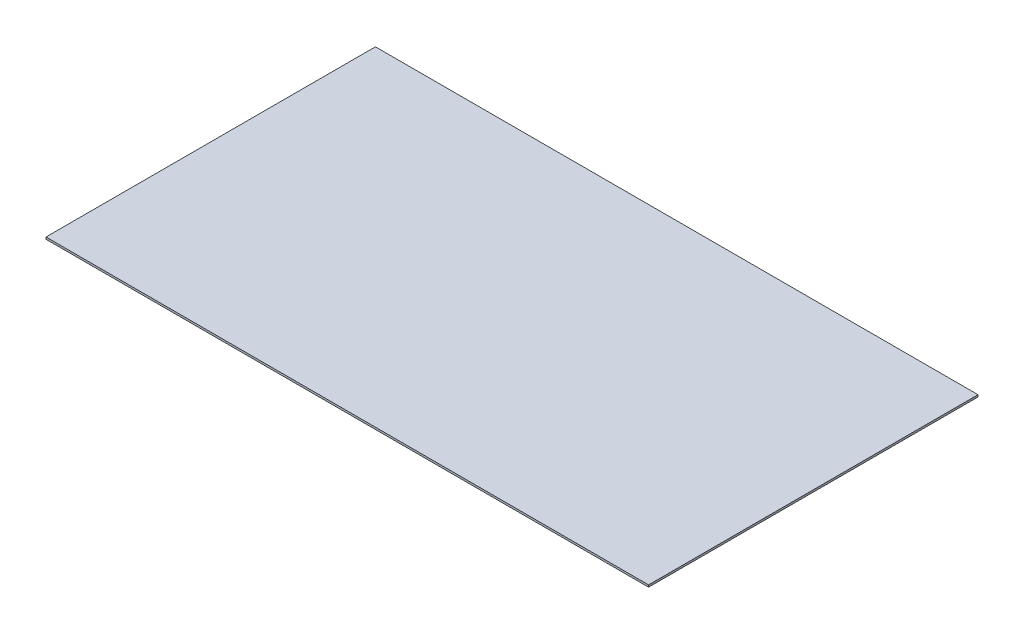
ISO-10303-21;
HEADER;
FILE_DESCRIPTION(('STEP AP214'),'2;1');
FILE_NAME('part.step','',(''),(''),'','','');
FILE_SCHEMA(('AUTOMOTIVE_DESIGN { 1 0 10303 214 1 1 1 1 }'));
ENDSEC;
DATA;
#1=APPLICATION_CONTEXT('core data for automotive mechanical design processes');
#2=APPLICATION_PROTOCOL_DEFINITION('international standard','automotive_design',2000,#1);
#3=PRODUCT_CONTEXT('',#1,'mechanical');
#4=PRODUCT('Part','Part','',(#3));
#5=PRODUCT_RELATED_PRODUCT_CATEGORY('part','',(#4));
#6=PRODUCT_DEFINITION_FORMATION('','',#4);
#7=PRODUCT_DEFINITION_CONTEXT('part definition',#1,'design');
#8=PRODUCT_DEFINITION('design','',#6,#7);
#9=PRODUCT_DEFINITION_SHAPE('','',#8);
#10=(LENGTH_UNIT() NAMED_UNIT(*) SI_UNIT(.MILLI.,.METRE.));
#11=(NAMED_UNIT(*) PLANE_ANGLE_UNIT() SI_UNIT($,.RADIAN.));
#12=(NAMED_UNIT(*) SI_UNIT($,.STERADIAN.) SOLID_ANGLE_UNIT());
#13=UNCERTAINTY_MEASURE_WITH_UNIT(LENGTH_MEASURE(1.E-05),#10,'distance_accuracy_value','');
#14=(GEOMETRIC_REPRESENTATION_CONTEXT(3) GLOBAL_UNCERTAINTY_ASSIGNED_CONTEXT((#13)) GLOBAL_UNIT_ASSIGNED_CONTEXT((#10,
#11,#12)) REPRESENTATION_CONTEXT('',''));
#15=CARTESIAN_POINT('',(0.,0.,0.));
#16=DIRECTION('',(0.,0.,1.));
#17=DIRECTION('',(1.,0.,0.));
#18=AXIS2_PLACEMENT_3D('',#15,#16,#17);
#19=CARTESIAN_POINT('',(238.125,1.5875,-130.175));
#20=DIRECTION('',(-1.,0.,0.));
#21=DIRECTION('',(0.,0.,1.));
#22=AXIS2_PLACEMENT_3D('',#19,#20,#21);
#23=PLANE('',#22);
#24=DIRECTION('',(0.,0.,-1.));
#25=VECTOR('',#24,1.);
#26=CARTESIAN_POINT('',(238.125,0.,-130.175));
#27=LINE('',#26,#25);
#28=CARTESIAN_POINT('',(238.125,0.,130.175));
#29=VERTEX_POINT('',#28);
#30=CARTESIAN_POINT('',(238.125,0.,-130.175));
#31=VERTEX_POINT('',#30);
#32=EDGE_CURVE('E98',#29,#31,#27,.T.);
#33=ORIENTED_EDGE('',*,*,#32,.T.);
#34=DIRECTION('',(0.,-1.,0.));
#35=VECTOR('',#34,1.);
#36=CARTESIAN_POINT('',(238.125,1.5875,-130.175));
#37=LINE('',#36,#35);
#38=CARTESIAN_POINT('',(238.125,1.5875,-130.175));
#39=VERTEX_POINT('',#38);
#40=EDGE_CURVE('E11',#39,#31,#37,.T.);
#41=ORIENTED_EDGE('',*,*,#40,.F.);
#42=DIRECTION('',(0.,0.,-1.));
#43=VECTOR('',#42,1.);
#44=CARTESIAN_POINT('',(238.125,1.5875,-130.175));
#45=LINE('',#44,#43);
#46=CARTESIAN_POINT('',(238.125,1.5875,130.175));
#47=VERTEX_POINT('',#46);
#48=EDGE_CURVE('E86',#47,#39,#45,.T.);
#49=ORIENTED_EDGE('',*,*,#48,.F.);
#50=DIRECTION('',(0.,-1.,0.));
#51=VECTOR('',#50,1.);
#52=CARTESIAN_POINT('',(238.125,1.5875,130.175));
#53=LINE('',#52,#51);
#54=EDGE_CURVE('E94',#47,#29,#53,.T.);
#55=ORIENTED_EDGE('',*,*,#54,.T.);
#56=EDGE_LOOP('',(#33,#41,#49,#55));
#57=FACE_BOUND('',#56,.T.);
#58=ADVANCED_FACE('F35',(#57),#23,.F.);
#59=CARTESIAN_POINT('',(-238.125,1.5875,-130.175));
#60=DIRECTION('',(0.,0.,1.));
#61=DIRECTION('',(1.,0.,0.));
#62=AXIS2_PLACEMENT_3D('',#59,#60,#61);
#63=PLANE('',#62);
#64=DIRECTION('',(-1.,0.,0.));
#65=VECTOR('',#64,1.);
#66=CARTESIAN_POINT('',(-238.125,0.,-130.175));
#67=LINE('',#66,#65);
#68=CARTESIAN_POINT('',(-238.125,0.,-130.175));
#69=VERTEX_POINT('',#68);
#70=EDGE_CURVE('E90',#31,#69,#67,.T.);
#71=ORIENTED_EDGE('',*,*,#70,.T.);
#72=DIRECTION('',(0.,-1.,0.));
#73=VECTOR('',#72,1.);
#74=CARTESIAN_POINT('',(-238.125,1.5875,-130.175));
#75=LINE('',#74,#73);
#76=CARTESIAN_POINT('',(-238.125,1.5875,-130.175));
#77=VERTEX_POINT('',#76);
#78=EDGE_CURVE('E43',#77,#69,#75,.T.);
#79=ORIENTED_EDGE('',*,*,#78,.F.);
#80=DIRECTION('',(-1.,0.,0.));
#81=VECTOR('',#80,1.);
#82=CARTESIAN_POINT('',(-238.125,1.5875,-130.175));
#83=LINE('',#82,#81);
#84=EDGE_CURVE('E81',#39,#77,#83,.T.);
#85=ORIENTED_EDGE('',*,*,#84,.F.);
#86=ORIENTED_EDGE('',*,*,#40,.T.);
#87=EDGE_LOOP('',(#71,#79,#85,#86));
#88=FACE_BOUND('',#87,.T.);
#89=ADVANCED_FACE('F89',(#88),#63,.F.);
#90=CARTESIAN_POINT('',(-238.125,1.5875,-130.175));
#91=DIRECTION('',(1.,0.,0.));
#92=DIRECTION('',(0.,0.,-1.));
#93=AXIS2_PLACEMENT_3D('',#90,#91,#92);
#94=PLANE('',#93);
#95=DIRECTION('',(0.,0.,1.));
#96=VECTOR('',#95,1.);
#97=CARTESIAN_POINT('',(-238.125,0.,-130.175));
#98=LINE('',#97,#96);
#99=CARTESIAN_POINT('',(-238.125,0.,130.175));
#100=VERTEX_POINT('',#99);
#101=EDGE_CURVE('E68',#69,#100,#98,.T.);
#102=ORIENTED_EDGE('',*,*,#101,.T.);
#103=DIRECTION('',(0.,-1.,0.));
#104=VECTOR('',#103,1.);
#105=CARTESIAN_POINT('',(-238.125,1.5875,130.175));
#106=LINE('',#105,#104);
#107=CARTESIAN_POINT('',(-238.125,1.5875,130.175));
#108=VERTEX_POINT('',#107);
#109=EDGE_CURVE('E91',#108,#100,#106,.T.);
#110=ORIENTED_EDGE('',*,*,#109,.F.);
#111=DIRECTION('',(0.,0.,1.));
#112=VECTOR('',#111,1.);
#113=CARTESIAN_POINT('',(-238.125,1.5875,-130.175));
#114=LINE('',#113,#112);
#115=EDGE_CURVE('E84',#77,#108,#114,.T.);
#116=ORIENTED_EDGE('',*,*,#115,.F.);
#117=ORIENTED_EDGE('',*,*,#78,.T.);
#118=EDGE_LOOP('',(#102,#110,#116,#117));
#119=FACE_BOUND('',#118,.T.);
#120=ADVANCED_FACE('F92',(#119),#94,.F.);
#121=CARTESIAN_POINT('',(-238.125,1.5875,130.175));
#122=DIRECTION('',(0.,0.,-1.));
#123=DIRECTION('',(-1.,0.,0.));
#124=AXIS2_PLACEMENT_3D('',#121,#122,#123);
#125=PLANE('',#124);
#126=DIRECTION('',(1.,0.,0.));
#127=VECTOR('',#126,1.);
#128=CARTESIAN_POINT('',(-238.125,0.,130.175));
#129=LINE('',#128,#127);
#130=EDGE_CURVE('E74',#100,#29,#129,.T.);
#131=ORIENTED_EDGE('',*,*,#130,.T.);
#132=ORIENTED_EDGE('',*,*,#54,.F.);
#133=DIRECTION('',(1.,0.,0.));
#134=VECTOR('',#133,1.);
#135=CARTESIAN_POINT('',(-238.125,1.5875,130.175));
#136=LINE('',#135,#134);
#137=EDGE_CURVE('E51',#108,#47,#136,.T.);
#138=ORIENTED_EDGE('',*,*,#137,.F.);
#139=ORIENTED_EDGE('',*,*,#109,.T.);
#140=EDGE_LOOP('',(#131,#132,#138,#139));
#141=FACE_BOUND('',#140,.T.);
#142=ADVANCED_FACE('F105',(#141),#125,.F.);
#143=CARTESIAN_POINT('',(0.,1.5875,0.));
#144=DIRECTION('',(0.,1.,0.));
#145=DIRECTION('',(0.,0.,1.));
#146=AXIS2_PLACEMENT_3D('',#143,#144,#145);
#147=PLANE('',#146);
#148=ORIENTED_EDGE('',*,*,#48,.T.);
#149=ORIENTED_EDGE('',*,*,#84,.T.);
#150=ORIENTED_EDGE('',*,*,#115,.T.);
#151=ORIENTED_EDGE('',*,*,#137,.T.);
#152=EDGE_LOOP('',(#148,#149,#150,#151));
#153=FACE_BOUND('',#152,.T.);
#154=ADVANCED_FACE('F82',(#153),#147,.T.);
#155=CARTESIAN_POINT('',(0.,0.,0.));
#156=DIRECTION('',(0.,1.,0.));
#157=DIRECTION('',(0.,0.,1.));
#158=AXIS2_PLACEMENT_3D('',#155,#156,#157);
#159=PLANE('',#158);
#160=ORIENTED_EDGE('',*,*,#32,.F.);
#161=ORIENTED_EDGE('',*,*,#130,.F.);
#162=ORIENTED_EDGE('',*,*,#101,.F.);
#163=ORIENTED_EDGE('',*,*,#70,.F.);
#164=EDGE_LOOP('',(#160,#161,#162,#163));
#165=FACE_BOUND('',#164,.T.);
#166=ADVANCED_FACE('F108',(#165),#159,.F.);
#167=CLOSED_SHELL('',(#58,#89,#120,#142,#154,#166));
#168=MANIFOLD_SOLID_BREP('B2',#167);
#169=ADVANCED_BREP_SHAPE_REPRESENTATION('',(#18,#168),#14);
#170=SHAPE_DEFINITION_REPRESENTATION(#9,#169);
ENDSEC;
END-ISO-10303-21;
